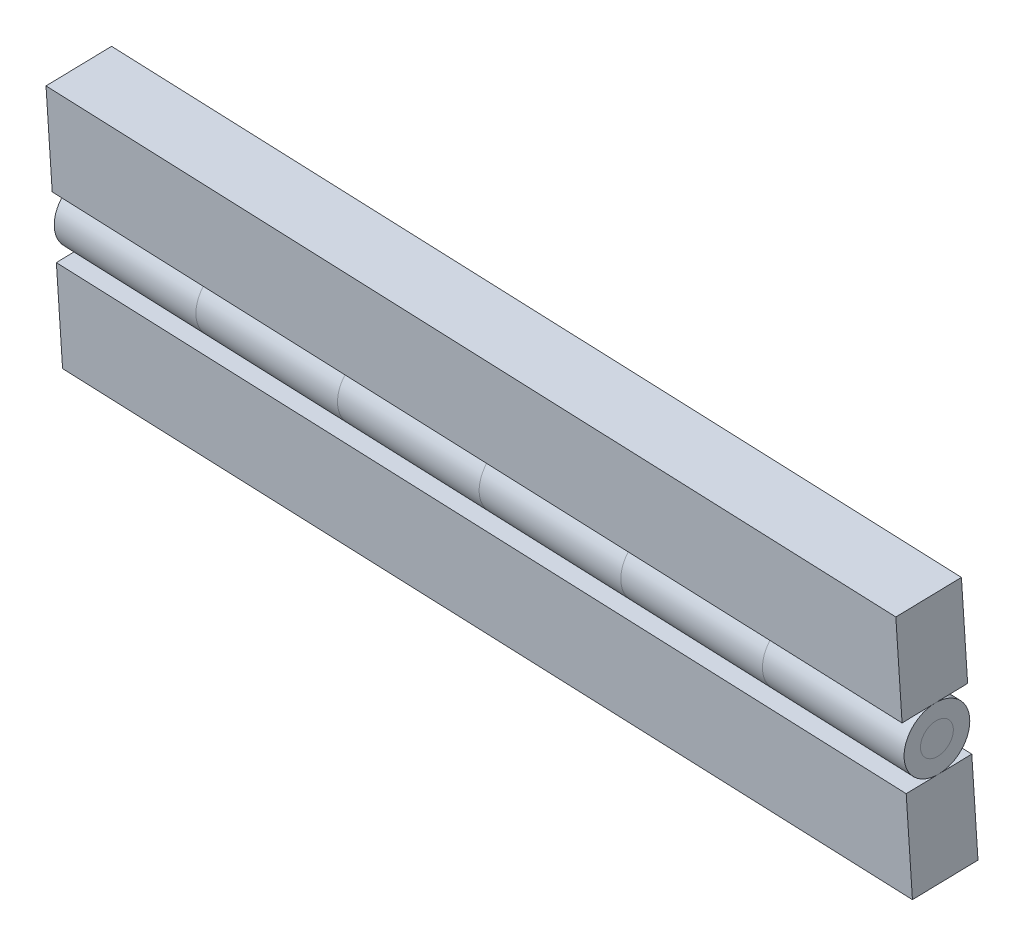
ISO-10303-21;
HEADER;
FILE_DESCRIPTION(('STEP AP214'),'2;1');
FILE_NAME('part.step','',(''),(''),'','','');
FILE_SCHEMA(('AUTOMOTIVE_DESIGN { 1 0 10303 214 1 1 1 1 }'));
ENDSEC;
DATA;
#1=APPLICATION_CONTEXT('core data for automotive mechanical design processes');
#2=APPLICATION_PROTOCOL_DEFINITION('international standard','automotive_design',2000,#1);
#3=PRODUCT_CONTEXT('',#1,'mechanical');
#4=PRODUCT('Part','Part','',(#3));
#5=PRODUCT_RELATED_PRODUCT_CATEGORY('part','',(#4));
#6=PRODUCT_DEFINITION_FORMATION('','',#4);
#7=PRODUCT_DEFINITION_CONTEXT('part definition',#1,'design');
#8=PRODUCT_DEFINITION('design','',#6,#7);
#9=PRODUCT_DEFINITION_SHAPE('','',#8);
#10=(LENGTH_UNIT() NAMED_UNIT(*) SI_UNIT(.MILLI.,.METRE.));
#11=(NAMED_UNIT(*) PLANE_ANGLE_UNIT() SI_UNIT($,.RADIAN.));
#12=(NAMED_UNIT(*) SI_UNIT($,.STERADIAN.) SOLID_ANGLE_UNIT());
#13=UNCERTAINTY_MEASURE_WITH_UNIT(LENGTH_MEASURE(1.E-05),#10,'distance_accuracy_value','');
#14=(GEOMETRIC_REPRESENTATION_CONTEXT(3) GLOBAL_UNCERTAINTY_ASSIGNED_CONTEXT((#13)) GLOBAL_UNIT_ASSIGNED_CONTEXT((#10,
#11,#12)) REPRESENTATION_CONTEXT('',''));
#15=CARTESIAN_POINT('',(0.,0.,0.));
#16=DIRECTION('',(0.,0.,1.));
#17=DIRECTION('',(1.,0.,0.));
#18=AXIS2_PLACEMENT_3D('',#15,#16,#17);
#19=CARTESIAN_POINT('',(-38.3742062643059,-23.8690353027162,37.3029888728331));
#20=DIRECTION('',(0.999218067831351,0.,0.0395379933656391));
#21=DIRECTION('',(-0.039425983073594,0.0752192234818832,0.996387304353816));
#22=AXIS2_PLACEMENT_3D('',#19,#20,#21);
#23=CYLINDRICAL_SURFACE('',#22,2.5);
#24=CARTESIAN_POINT('',(31.5710584838887,-23.8690353027163,40.0706484084279));
#25=DIRECTION('',(0.999218067831351,0.,0.0395379933656391));
#26=DIRECTION('',(-0.039425983073594,0.0752192234818832,0.996387304353816));
#27=AXIS2_PLACEMENT_3D('',#24,#25,#26);
#28=CIRCLE('',#27,2.5);
#29=CARTESIAN_POINT('',(31.4724935262047,-23.6809872440116,42.5616166693124));
#30=VERTEX_POINT('',#29);
#31=EDGE_CURVE('P0_E10',#30,#30,#28,.T.);
#32=ORIENTED_EDGE('',*,*,#31,.F.);
#33=EDGE_LOOP('',(#32));
#34=FACE_BOUND('',#33,.T.);
#35=CARTESIAN_POINT('',(-108.3194710125,-23.8690353027162,34.5353293372384));
#36=DIRECTION('',(0.999218067831351,0.,0.0395379933656391));
#37=DIRECTION('',(-0.039425983073594,0.0752192234818832,0.996387304353816));
#38=AXIS2_PLACEMENT_3D('',#35,#36,#37);
#39=CIRCLE('',#38,2.5);
#40=CARTESIAN_POINT('',(-108.418035970184,-23.6809872440115,37.0262975981229));
#41=VERTEX_POINT('',#40);
#42=EDGE_CURVE('P0_E19',#41,#41,#39,.T.);
#43=ORIENTED_EDGE('',*,*,#42,.T.);
#44=EDGE_LOOP('',(#43));
#45=FACE_BOUND('',#44,.T.);
#46=ADVANCED_FACE('P0_F15',(#34,#45),#23,.T.);
#47=CARTESIAN_POINT('',(-108.3194710125,-23.8690353027162,34.5353293372384));
#48=DIRECTION('',(0.999218067831351,0.,0.0395379933656391));
#49=DIRECTION('',(-0.039425983073594,0.0752192234818832,0.996387304353816));
#50=AXIS2_PLACEMENT_3D('',#47,#48,#49);
#51=PLANE('',#50);
#52=ORIENTED_EDGE('',*,*,#42,.F.);
#53=EDGE_LOOP('',(#52));
#54=FACE_BOUND('',#53,.T.);
#55=ADVANCED_FACE('P0_F29',(#54),#51,.F.);
#56=CARTESIAN_POINT('',(31.5710584838887,-23.8690353027163,40.0706484084279));
#57=DIRECTION('',(0.999218067831351,0.,0.0395379933656391));
#58=DIRECTION('',(-0.039425983073594,0.0752192234818832,0.996387304353816));
#59=AXIS2_PLACEMENT_3D('',#56,#57,#58);
#60=PLANE('',#59);
#61=ORIENTED_EDGE('',*,*,#31,.T.);
#62=EDGE_LOOP('',(#61));
#63=FACE_BOUND('',#62,.T.);
#64=ADVANCED_FACE('P0_F17',(#63),#60,.T.);
#65=CLOSED_SHELL('',(#46,#55,#64));
#66=MANIFOLD_SOLID_BREP('P0_B1',#65);
#67=CARTESIAN_POINT('',(19.9135143591896,-23.8690353027163,39.6093718191621));
#68=DIRECTION('',(0.999218067831351,0.,0.0395379933656391));
#69=DIRECTION('',(-0.0394591993984671,-0.0631012102172843,0.997226758993132));
#70=AXIS2_PLACEMENT_3D('',#67,#68,#69);
#71=CYLINDRICAL_SURFACE('',#70,5.);
#72=CARTESIAN_POINT('',(-85.0043827631022,-23.8690353027162,35.45788251577));
#73=DIRECTION('',(0.999218067831351,0.,0.0395379933656391));
#74=DIRECTION('',(-0.0394591993984671,-0.0631012102172843,0.997226758993132));
#75=AXIS2_PLACEMENT_3D('',#72,#73,#74);
#76=CIRCLE('',#75,5.);
#77=CARTESIAN_POINT('',(-85.2016787600946,-24.1845413538026,40.4440163107356));
#78=VERTEX_POINT('',#77);
#79=EDGE_CURVE('P1_E27',#78,#78,#76,.T.);
#80=ORIENTED_EDGE('',*,*,#79,.T.);
#81=EDGE_LOOP('',(#80));
#82=FACE_BOUND('',#81,.T.);
#83=CARTESIAN_POINT('',(-61.689294513704,-23.8690353027162,36.3804356943016));
#84=DIRECTION('',(0.999218067831351,0.,0.0395379933656391));
#85=DIRECTION('',(-0.0394591993984671,-0.0631012102172843,0.997226758993132));
#86=AXIS2_PLACEMENT_3D('',#83,#84,#85);
#87=CIRCLE('',#86,5.);
#88=CARTESIAN_POINT('',(-61.8865905106964,-24.1845413538026,41.3665694892672));
#89=VERTEX_POINT('',#88);
#90=EDGE_CURVE('P1_E9',#89,#89,#87,.T.);
#91=ORIENTED_EDGE('',*,*,#90,.F.);
#92=EDGE_LOOP('',(#91));
#93=FACE_BOUND('',#92,.T.);
#94=ADVANCED_FACE('P1_F14',(#82,#93),#71,.T.);
#95=CARTESIAN_POINT('',(-61.8990649868511,-19.1945056894283,41.6818288360229));
#96=DIRECTION('',(-0.999218067831351,0.,-0.0395379933656391));
#97=DIRECTION('',(0.0394591993984671,0.0631012102172843,-0.997226758993132));
#98=AXIS2_PLACEMENT_3D('',#95,#96,#97);
#99=PLANE('',#98);
#100=ORIENTED_EDGE('',*,*,#90,.T.);
#101=EDGE_LOOP('',(#100));
#102=FACE_BOUND('',#101,.T.);
#103=CARTESIAN_POINT('',(-61.689294513704,-23.8690353027162,36.3804356943016));
#104=DIRECTION('',(0.999218067831351,0.,0.0395379933656391));
#105=DIRECTION('',(0.0394591993984671,0.0631012102172843,-0.997226758993132));
#106=AXIS2_PLACEMENT_3D('',#103,#104,#105);
#107=CIRCLE('',#106,2.5);
#108=CARTESIAN_POINT('',(-61.5906465152079,-23.711282277173,33.8873687968187));
#109=VERTEX_POINT('',#108);
#110=EDGE_CURVE('P1_E22',#109,#109,#107,.T.);
#111=ORIENTED_EDGE('',*,*,#110,.F.);
#112=EDGE_LOOP('',(#111));
#113=FACE_BOUND('',#112,.T.);
#114=ADVANCED_FACE('P1_F41',(#102,#113),#99,.F.);
#115=CARTESIAN_POINT('',(-85.2328649504812,-11.7094521928668,41.2321646776248));
#116=DIRECTION('',(0.999218067831351,0.,0.0395379933656391));
#117=DIRECTION('',(-0.0394591993984671,-0.0631012102172843,0.997226758993132));
#118=AXIS2_PLACEMENT_3D('',#115,#116,#117);
#119=PLANE('',#118);
#120=ORIENTED_EDGE('',*,*,#79,.F.);
#121=EDGE_LOOP('',(#120));
#122=FACE_BOUND('',#121,.T.);
#123=CARTESIAN_POINT('',(-85.0043827631022,-23.8690353027162,35.45788251577));
#124=DIRECTION('',(0.999218067831351,0.,0.0395379933656391));
#125=DIRECTION('',(-0.0394591993984671,-0.0631012102172843,0.997226758993132));
#126=AXIS2_PLACEMENT_3D('',#123,#124,#125);
#127=CIRCLE('',#126,2.5);
#128=CARTESIAN_POINT('',(-85.1030307615984,-24.0267883282594,37.9509494132528));
#129=VERTEX_POINT('',#128);
#130=EDGE_CURVE('P1_E18',#129,#129,#127,.T.);
#131=ORIENTED_EDGE('',*,*,#130,.T.);
#132=EDGE_LOOP('',(#131));
#133=FACE_BOUND('',#132,.T.);
#134=ADVANCED_FACE('P1_F35',(#122,#133),#119,.F.);
#135=CARTESIAN_POINT('',(19.9135143591896,-23.8690353027163,39.6093718191621));
#136=DIRECTION('',(0.999218067831351,0.,0.0395379933656391));
#137=DIRECTION('',(-0.0394591993984671,-0.0631012102172843,0.997226758993132));
#138=AXIS2_PLACEMENT_3D('',#135,#136,#137);
#139=CYLINDRICAL_SURFACE('',#138,2.5);
#140=ORIENTED_EDGE('',*,*,#130,.F.);
#141=EDGE_LOOP('',(#140));
#142=FACE_BOUND('',#141,.T.);
#143=ORIENTED_EDGE('',*,*,#110,.T.);
#144=EDGE_LOOP('',(#143));
#145=FACE_BOUND('',#144,.T.);
#146=ADVANCED_FACE('P1_F16',(#142,#145),#139,.F.);
#147=CLOSED_SHELL('',(#94,#114,#134,#146));
#148=MANIFOLD_SOLID_BREP('P1_B1',#147);
#149=CARTESIAN_POINT('',(19.9135143591896,-23.8690353027163,39.6093718191621));
#150=DIRECTION('',(0.999218067831351,0.,0.0395379933656391));
#151=DIRECTION('',(-0.0394591993984671,-0.0631012102172843,0.997226758993132));
#152=AXIS2_PLACEMENT_3D('',#149,#150,#151);
#153=CYLINDRICAL_SURFACE('',#152,5.);
#154=CARTESIAN_POINT('',(-38.3742062643059,-23.8690353027162,37.3029888728331));
#155=DIRECTION('',(0.999218067831351,0.,0.0395379933656391));
#156=DIRECTION('',(-0.0394591993984671,-0.0631012102172843,0.997226758993132));
#157=AXIS2_PLACEMENT_3D('',#154,#155,#156);
#158=CIRCLE('',#157,5.);
#159=CARTESIAN_POINT('',(-38.5715022612982,-24.1845413538027,42.2891226677988));
#160=VERTEX_POINT('',#159);
#161=EDGE_CURVE('P2_E28',#160,#160,#158,.T.);
#162=ORIENTED_EDGE('',*,*,#161,.T.);
#163=EDGE_LOOP('',(#162));
#164=FACE_BOUND('',#163,.T.);
#165=CARTESIAN_POINT('',(-15.0591180149077,-23.8690353027163,38.2255420513647));
#166=DIRECTION('',(0.999218067831351,0.,0.0395379933656391));
#167=DIRECTION('',(-0.0394591993984671,-0.0631012102172843,0.997226758993132));
#168=AXIS2_PLACEMENT_3D('',#165,#166,#167);
#169=CIRCLE('',#168,5.);
#170=CARTESIAN_POINT('',(-15.2564140119,-24.1845413538027,43.2116758463304));
#171=VERTEX_POINT('',#170);
#172=EDGE_CURVE('P2_E10',#171,#171,#169,.T.);
#173=ORIENTED_EDGE('',*,*,#172,.F.);
#174=EDGE_LOOP('',(#173));
#175=FACE_BOUND('',#174,.T.);
#176=ADVANCED_FACE('P2_F15',(#164,#175),#153,.T.);
#177=CARTESIAN_POINT('',(-15.2688884880547,-19.1945056894284,43.526935193086));
#178=DIRECTION('',(-0.999218067831351,0.,-0.0395379933656391));
#179=DIRECTION('',(0.0394591993984671,0.0631012102172843,-0.997226758993132));
#180=AXIS2_PLACEMENT_3D('',#177,#178,#179);
#181=PLANE('',#180);
#182=ORIENTED_EDGE('',*,*,#172,.T.);
#183=EDGE_LOOP('',(#182));
#184=FACE_BOUND('',#183,.T.);
#185=CARTESIAN_POINT('',(-15.0591180149077,-23.8690353027163,38.2255420513647));
#186=DIRECTION('',(0.999218067831351,0.,0.0395379933656391));
#187=DIRECTION('',(0.0394591993984671,0.0631012102172843,-0.997226758993132));
#188=AXIS2_PLACEMENT_3D('',#185,#186,#187);
#189=CIRCLE('',#188,2.5);
#190=CARTESIAN_POINT('',(-14.9604700164115,-23.7112822771731,35.7324751538819));
#191=VERTEX_POINT('',#190);
#192=EDGE_CURVE('P2_E23',#191,#191,#189,.T.);
#193=ORIENTED_EDGE('',*,*,#192,.F.);
#194=EDGE_LOOP('',(#193));
#195=FACE_BOUND('',#194,.T.);
#196=ADVANCED_FACE('P2_F42',(#184,#195),#181,.F.);
#197=CARTESIAN_POINT('',(-38.6026884516849,-11.7094521928668,43.077271034688));
#198=DIRECTION('',(0.999218067831351,0.,0.0395379933656391));
#199=DIRECTION('',(-0.0394591993984671,-0.0631012102172843,0.997226758993132));
#200=AXIS2_PLACEMENT_3D('',#197,#198,#199);
#201=PLANE('',#200);
#202=ORIENTED_EDGE('',*,*,#161,.F.);
#203=EDGE_LOOP('',(#202));
#204=FACE_BOUND('',#203,.T.);
#205=CARTESIAN_POINT('',(-38.3742062643059,-23.8690353027162,37.3029888728331));
#206=DIRECTION('',(0.999218067831351,0.,0.0395379933656391));
#207=DIRECTION('',(-0.0394591993984671,-0.0631012102172843,0.997226758993132));
#208=AXIS2_PLACEMENT_3D('',#205,#206,#207);
#209=CIRCLE('',#208,2.5);
#210=CARTESIAN_POINT('',(-38.472854262802,-24.0267883282595,39.796055770316));
#211=VERTEX_POINT('',#210);
#212=EDGE_CURVE('P2_E19',#211,#211,#209,.T.);
#213=ORIENTED_EDGE('',*,*,#212,.T.);
#214=EDGE_LOOP('',(#213));
#215=FACE_BOUND('',#214,.T.);
#216=ADVANCED_FACE('P2_F36',(#204,#215),#201,.F.);
#217=CARTESIAN_POINT('',(19.9135143591896,-23.8690353027163,39.6093718191621));
#218=DIRECTION('',(0.999218067831351,0.,0.0395379933656391));
#219=DIRECTION('',(-0.0394591993984671,-0.0631012102172843,0.997226758993132));
#220=AXIS2_PLACEMENT_3D('',#217,#218,#219);
#221=CYLINDRICAL_SURFACE('',#220,2.5);
#222=ORIENTED_EDGE('',*,*,#212,.F.);
#223=EDGE_LOOP('',(#222));
#224=FACE_BOUND('',#223,.T.);
#225=ORIENTED_EDGE('',*,*,#192,.T.);
#226=EDGE_LOOP('',(#225));
#227=FACE_BOUND('',#226,.T.);
#228=ADVANCED_FACE('P2_F17',(#224,#227),#221,.F.);
#229=CLOSED_SHELL('',(#176,#196,#216,#228));
#230=MANIFOLD_SOLID_BREP('P2_B1',#229);
#231=CARTESIAN_POINT('',(-108.566664914111,-4.22439869630523,40.7825005192268));
#232=DIRECTION('',(0.999218067831351,0.,0.0395379933656391));
#233=DIRECTION('',(-0.0394591993984671,-0.0631012102172843,0.997226758993132));
#234=AXIS2_PLACEMENT_3D('',#231,#232,#233);
#235=PLANE('',#234);
#236=DIRECTION('',(-0.00249489523093393,0.998007132874868,0.0630518693511348));
#237=VECTOR('',#236,1.);
#238=CARTESIAN_POINT('',(-108.153361205895,-11.0784400906939,30.3373439091619));
#239=LINE('',#238,#237);
#240=CARTESIAN_POINT('',(-108.134649491663,-18.5634935872554,29.8644548890284));
#241=VERTEX_POINT('',#240);
#242=CARTESIAN_POINT('',(-108.172072920127,-3.59338659413239,30.8102329292954));
#243=VERTEX_POINT('',#242);
#244=EDGE_CURVE('P3_E11',#241,#243,#239,.T.);
#245=ORIENTED_EDGE('',*,*,#244,.F.);
#246=DIRECTION('',(0.0394591993984671,0.0631012102172843,-0.997226758993132));
#247=VECTOR('',#246,1.);
#248=CARTESIAN_POINT('',(-108.331945488655,-18.8789996383419,34.8505886839941));
#249=LINE('',#248,#247);
#250=CARTESIAN_POINT('',(-108.529241485647,-19.1945056894283,39.8367224789597));
#251=VERTEX_POINT('',#250);
#252=EDGE_CURVE('P3_E27',#251,#241,#249,.T.);
#253=ORIENTED_EDGE('',*,*,#252,.F.);
#254=DIRECTION('',(-0.00249489523093393,0.998007132874868,0.0630518693511348));
#255=VECTOR('',#254,1.);
#256=CARTESIAN_POINT('',(-108.547953199879,-11.7094521928668,40.3096114990932));
#257=LINE('',#256,#255);
#258=CARTESIAN_POINT('',(-108.566664914111,-4.22439869630523,40.7825005192268));
#259=VERTEX_POINT('',#258);
#260=EDGE_CURVE('P3_E75',#251,#259,#257,.T.);
#261=ORIENTED_EDGE('',*,*,#260,.T.);
#262=DIRECTION('',(0.0394591993984671,0.0631012102172843,-0.997226758993132));
#263=VECTOR('',#262,1.);
#264=CARTESIAN_POINT('',(-108.369368917119,-3.90889264521881,35.7963667242611));
#265=LINE('',#264,#263);
#266=EDGE_CURVE('P3_E36',#259,#243,#265,.T.);
#267=ORIENTED_EDGE('',*,*,#266,.T.);
#268=EDGE_LOOP('',(#245,#253,#261,#267));
#269=FACE_BOUND('',#268,.T.);
#270=ADVANCED_FACE('P3_F17',(#269),#235,.F.);
#271=CARTESIAN_POINT('',(31.3238645822777,-4.22439869630536,46.3178195904162));
#272=DIRECTION('',(0.00249489523093393,-0.998007132874868,-0.0630518693511348));
#273=DIRECTION('',(0.0394591993984671,0.0631012102172843,-0.997226758993132));
#274=AXIS2_PLACEMENT_3D('',#271,#272,#273);
#275=PLANE('',#274);
#276=DIRECTION('',(0.999218067831351,0.,0.0395379933656391));
#277=VECTOR('',#276,1.);
#278=CARTESIAN_POINT('',(-38.2268081719322,-3.59338659413245,33.5778924648902));
#279=LINE('',#278,#277);
#280=CARTESIAN_POINT('',(31.7184565762624,-3.59338659413251,36.3455520004849));
#281=VERTEX_POINT('',#280);
#282=EDGE_CURVE('P3_E83',#243,#281,#279,.T.);
#283=ORIENTED_EDGE('',*,*,#282,.F.);
#284=ORIENTED_EDGE('',*,*,#266,.F.);
#285=DIRECTION('',(0.999218067831351,0.,0.0395379933656391));
#286=VECTOR('',#285,1.);
#287=CARTESIAN_POINT('',(-38.6214001659169,-4.2243986963053,43.5501600548215));
#288=LINE('',#287,#286);
#289=CARTESIAN_POINT('',(31.3238645822777,-4.22439869630536,46.3178195904162));
#290=VERTEX_POINT('',#289);
#291=EDGE_CURVE('P3_E72',#259,#290,#288,.T.);
#292=ORIENTED_EDGE('',*,*,#291,.T.);
#293=DIRECTION('',(0.0394591993984671,0.0631012102172843,-0.997226758993132));
#294=VECTOR('',#293,1.);
#295=CARTESIAN_POINT('',(31.52116057927,-3.90889264521894,41.3316857954506));
#296=LINE('',#295,#294);
#297=EDGE_CURVE('P3_E69',#290,#281,#296,.T.);
#298=ORIENTED_EDGE('',*,*,#297,.T.);
#299=EDGE_LOOP('',(#283,#284,#292,#298));
#300=FACE_BOUND('',#299,.T.);
#301=ADVANCED_FACE('P3_F91',(#300),#275,.F.);
#302=CARTESIAN_POINT('',(31.3612880107417,-19.1945056894284,45.3720415501492));
#303=DIRECTION('',(-0.999218067831351,0.,-0.0395379933656391));
#304=DIRECTION('',(0.0394591993984671,0.0631012102172843,-0.997226758993132));
#305=AXIS2_PLACEMENT_3D('',#302,#303,#304);
#306=PLANE('',#305);
#307=DIRECTION('',(0.00249489523093393,-0.998007132874868,-0.0630518693511348));
#308=VECTOR('',#307,1.);
#309=CARTESIAN_POINT('',(31.7371682904944,-11.078440090694,35.8726629803514));
#310=LINE('',#309,#308);
#311=CARTESIAN_POINT('',(31.7558800047264,-18.5634935872555,35.3997739602179));
#312=VERTEX_POINT('',#311);
#313=EDGE_CURVE('P3_E77',#281,#312,#310,.T.);
#314=ORIENTED_EDGE('',*,*,#313,.F.);
#315=ORIENTED_EDGE('',*,*,#297,.F.);
#316=DIRECTION('',(0.00249489523093393,-0.998007132874868,-0.0630518693511348));
#317=VECTOR('',#316,1.);
#318=CARTESIAN_POINT('',(31.3425762965097,-11.7094521928669,45.8449305702827));
#319=LINE('',#318,#317);
#320=CARTESIAN_POINT('',(31.3612880107417,-19.1945056894284,45.3720415501492));
#321=VERTEX_POINT('',#320);
#322=EDGE_CURVE('P3_E64',#290,#321,#319,.T.);
#323=ORIENTED_EDGE('',*,*,#322,.T.);
#324=DIRECTION('',(0.0394591993984671,0.0631012102172843,-0.997226758993132));
#325=VECTOR('',#324,1.);
#326=CARTESIAN_POINT('',(31.6572320062302,-18.7212466127988,37.8928408577007));
#327=LINE('',#326,#325);
#328=EDGE_CURVE('P3_E55',#321,#312,#327,.T.);
#329=ORIENTED_EDGE('',*,*,#328,.T.);
#330=EDGE_LOOP('',(#314,#315,#323,#329));
#331=FACE_BOUND('',#330,.T.);
#332=ADVANCED_FACE('P3_F68',(#331),#306,.F.);
#333=CARTESIAN_POINT('',(-38.6026884516849,-11.7094521928668,43.077271034688));
#334=DIRECTION('',(0.0394591993984671,0.0631012102172843,-0.997226758993132));
#335=DIRECTION('',(0.999218067831351,0.,0.0395379933656391));
#336=AXIS2_PLACEMENT_3D('',#333,#334,#335);
#337=PLANE('',#336);
#338=DIRECTION('',(-0.999218067831351,0.,-0.0395379933656391));
#339=VECTOR('',#338,1.);
#340=CARTESIAN_POINT('',(-38.5839767374529,-19.1945056894283,42.6043820145545));
#341=LINE('',#340,#339);
#342=EDGE_CURVE('P3_E62',#321,#251,#341,.T.);
#343=ORIENTED_EDGE('',*,*,#342,.F.);
#344=ORIENTED_EDGE('',*,*,#322,.F.);
#345=ORIENTED_EDGE('',*,*,#291,.F.);
#346=ORIENTED_EDGE('',*,*,#260,.F.);
#347=EDGE_LOOP('',(#343,#344,#345,#346));
#348=FACE_BOUND('',#347,.T.);
#349=ADVANCED_FACE('P3_F74',(#348),#337,.F.);
#350=CARTESIAN_POINT('',(-38.2080964577002,-11.078440090694,33.1050034447567));
#351=DIRECTION('',(0.0394591993984671,0.0631012102172843,-0.997226758993132));
#352=DIRECTION('',(0.999218067831351,0.,0.0395379933656391));
#353=AXIS2_PLACEMENT_3D('',#350,#351,#352);
#354=PLANE('',#353);
#355=ORIENTED_EDGE('',*,*,#313,.T.);
#356=DIRECTION('',(-0.999218067831351,0.,-0.0395379933656391));
#357=VECTOR('',#356,1.);
#358=CARTESIAN_POINT('',(-38.1893847434682,-18.5634935872555,32.6321144246232));
#359=LINE('',#358,#357);
#360=EDGE_CURVE('P3_E21',#312,#241,#359,.T.);
#361=ORIENTED_EDGE('',*,*,#360,.T.);
#362=ORIENTED_EDGE('',*,*,#244,.T.);
#363=ORIENTED_EDGE('',*,*,#282,.T.);
#364=EDGE_LOOP('',(#355,#361,#362,#363));
#365=FACE_BOUND('',#364,.T.);
#366=ADVANCED_FACE('P3_F89',(#365),#354,.T.);
#367=CARTESIAN_POINT('',(-108.529241485647,-19.1945056894283,39.8367224789597));
#368=DIRECTION('',(-0.00249489523093393,0.998007132874868,0.0630518693511348));
#369=DIRECTION('',(-0.0394591993984671,-0.0631012102172843,0.997226758993132));
#370=AXIS2_PLACEMENT_3D('',#367,#368,#369);
#371=PLANE('',#370);
#372=ORIENTED_EDGE('',*,*,#328,.F.);
#373=ORIENTED_EDGE('',*,*,#342,.T.);
#374=ORIENTED_EDGE('',*,*,#252,.T.);
#375=ORIENTED_EDGE('',*,*,#360,.F.);
#376=EDGE_LOOP('',(#372,#373,#374,#375));
#377=FACE_BOUND('',#376,.T.);
#378=ADVANCED_FACE('P3_F19',(#377),#371,.F.);
#379=CLOSED_SHELL('',(#270,#301,#332,#349,#366,#378));
#380=MANIFOLD_SOLID_BREP('P3_B1',#379);
#381=CARTESIAN_POINT('',(19.9135143591896,-23.8690353027163,39.6093718191621));
#382=DIRECTION('',(0.999218067831351,0.,0.0395379933656391));
#383=DIRECTION('',(-0.0394591993984671,-0.0631012102172843,0.997226758993132));
#384=AXIS2_PLACEMENT_3D('',#381,#382,#383);
#385=CYLINDRICAL_SURFACE('',#384,5.);
#386=CARTESIAN_POINT('',(8.25597023449053,-23.8690353027163,39.1480952298963));
#387=DIRECTION('',(0.999218067831351,0.,0.0395379933656391));
#388=DIRECTION('',(-0.0394591993984671,-0.0631012102172843,0.997226758993132));
#389=AXIS2_PLACEMENT_3D('',#386,#387,#388);
#390=CIRCLE('',#389,5.);
#391=CARTESIAN_POINT('',(8.0586742374982,-24.1845413538027,44.134229024862));
#392=VERTEX_POINT('',#391);
#393=EDGE_CURVE('P4_E29',#392,#392,#390,.T.);
#394=ORIENTED_EDGE('',*,*,#393,.T.);
#395=EDGE_LOOP('',(#394));
#396=FACE_BOUND('',#395,.T.);
#397=CARTESIAN_POINT('',(31.5710584838887,-23.8690353027163,40.0706484084279));
#398=DIRECTION('',(0.999218067831351,0.,0.0395379933656391));
#399=DIRECTION('',(-0.0394591993984671,-0.0631012102172843,0.997226758993132));
#400=AXIS2_PLACEMENT_3D('',#397,#398,#399);
#401=CIRCLE('',#400,5.);
#402=CARTESIAN_POINT('',(31.3737624868964,-24.1845413538027,45.0567822033935));
#403=VERTEX_POINT('',#402);
#404=EDGE_CURVE('P4_E10',#403,#403,#401,.T.);
#405=ORIENTED_EDGE('',*,*,#404,.F.);
#406=EDGE_LOOP('',(#405));
#407=FACE_BOUND('',#406,.T.);
#408=ADVANCED_FACE('P4_F15',(#396,#407),#385,.T.);
#409=CARTESIAN_POINT('',(19.9135143591896,-23.8690353027163,39.6093718191621));
#410=DIRECTION('',(0.999218067831351,0.,0.0395379933656391));
#411=DIRECTION('',(-0.0394591993984671,-0.0631012102172843,0.997226758993132));
#412=AXIS2_PLACEMENT_3D('',#409,#410,#411);
#413=CYLINDRICAL_SURFACE('',#412,2.5);
#414=CARTESIAN_POINT('',(8.25597023449053,-23.8690353027163,39.1480952298963));
#415=DIRECTION('',(0.999218067831351,0.,0.0395379933656391));
#416=DIRECTION('',(-0.0394591993984671,-0.0631012102172843,0.997226758993132));
#417=AXIS2_PLACEMENT_3D('',#414,#415,#416);
#418=CIRCLE('',#417,2.5);
#419=CARTESIAN_POINT('',(8.15732223599436,-24.0267883282595,41.6411621273791));
#420=VERTEX_POINT('',#419);
#421=EDGE_CURVE('P4_E23',#420,#420,#418,.T.);
#422=ORIENTED_EDGE('',*,*,#421,.F.);
#423=EDGE_LOOP('',(#422));
#424=FACE_BOUND('',#423,.T.);
#425=CARTESIAN_POINT('',(31.5710584838887,-23.8690353027163,40.0706484084279));
#426=DIRECTION('',(0.999218067831351,0.,0.0395379933656391));
#427=DIRECTION('',(-0.0394591993984671,-0.0631012102172843,0.997226758993132));
#428=AXIS2_PLACEMENT_3D('',#425,#426,#427);
#429=CIRCLE('',#428,2.5);
#430=CARTESIAN_POINT('',(31.4724104853925,-24.0267883282595,42.5637153059107));
#431=VERTEX_POINT('',#430);
#432=EDGE_CURVE('P4_E19',#431,#431,#429,.T.);
#433=ORIENTED_EDGE('',*,*,#432,.T.);
#434=EDGE_LOOP('',(#433));
#435=FACE_BOUND('',#434,.T.);
#436=ADVANCED_FACE('P4_F36',(#424,#435),#413,.F.);
#437=CARTESIAN_POINT('',(31.3612880107417,-19.1945056894284,45.3720415501492));
#438=DIRECTION('',(-0.999218067831351,0.,-0.0395379933656391));
#439=DIRECTION('',(0.0394591993984671,0.0631012102172843,-0.997226758993132));
#440=AXIS2_PLACEMENT_3D('',#437,#438,#439);
#441=PLANE('',#440);
#442=ORIENTED_EDGE('',*,*,#404,.T.);
#443=EDGE_LOOP('',(#442));
#444=FACE_BOUND('',#443,.T.);
#445=ORIENTED_EDGE('',*,*,#432,.F.);
#446=EDGE_LOOP('',(#445));
#447=FACE_BOUND('',#446,.T.);
#448=ADVANCED_FACE('P4_F38',(#444,#447),#441,.F.);
#449=CARTESIAN_POINT('',(8.02748804711152,-11.7094521928669,44.9223773917511));
#450=DIRECTION('',(0.999218067831351,0.,0.0395379933656391));
#451=DIRECTION('',(-0.0394591993984671,-0.0631012102172843,0.997226758993132));
#452=AXIS2_PLACEMENT_3D('',#449,#450,#451);
#453=PLANE('',#452);
#454=ORIENTED_EDGE('',*,*,#393,.F.);
#455=EDGE_LOOP('',(#454));
#456=FACE_BOUND('',#455,.T.);
#457=ORIENTED_EDGE('',*,*,#421,.T.);
#458=EDGE_LOOP('',(#457));
#459=FACE_BOUND('',#458,.T.);
#460=ADVANCED_FACE('P4_F17',(#456,#459),#453,.F.);
#461=CLOSED_SHELL('',(#408,#436,#448,#460));
#462=MANIFOLD_SOLID_BREP('P4_B1',#461);
#463=CARTESIAN_POINT('',(-96.6619268878013,-23.8690353027162,34.9966059265042));
#464=DIRECTION('',(-0.999218067831351,0.,-0.0395379933656391));
#465=DIRECTION('',(-0.0394591993984672,-0.0631012102172478,0.997226758993134));
#466=AXIS2_PLACEMENT_3D('',#463,#464,#465);
#467=CYLINDRICAL_SURFACE('',#466,5.);
#468=CARTESIAN_POINT('',(8.25597023449056,-23.8690353027163,39.1480952298963));
#469=DIRECTION('',(-0.999218067831351,0.,-0.0395379933656391));
#470=DIRECTION('',(-0.0394591993984672,-0.0631012102172478,0.997226758993134));
#471=AXIS2_PLACEMENT_3D('',#468,#469,#470);
#472=CIRCLE('',#471,5.);
#473=CARTESIAN_POINT('',(8.05867423749822,-24.1845413538025,44.134229024862));
#474=VERTEX_POINT('',#473);
#475=EDGE_CURVE('P5_E28',#474,#474,#472,.T.);
#476=ORIENTED_EDGE('',*,*,#475,.T.);
#477=EDGE_LOOP('',(#476));
#478=FACE_BOUND('',#477,.T.);
#479=CARTESIAN_POINT('',(-15.0591180149076,-23.8690353027163,38.2255420513647));
#480=DIRECTION('',(-0.999218067831351,0.,-0.0395379933656391));
#481=DIRECTION('',(-0.0394591993984672,-0.0631012102172478,0.997226758993134));
#482=AXIS2_PLACEMENT_3D('',#479,#480,#481);
#483=CIRCLE('',#482,5.);
#484=CARTESIAN_POINT('',(-15.2564140119,-24.1845413538025,43.2116758463304));
#485=VERTEX_POINT('',#484);
#486=EDGE_CURVE('P5_E10',#485,#485,#483,.T.);
#487=ORIENTED_EDGE('',*,*,#486,.F.);
#488=EDGE_LOOP('',(#487));
#489=FACE_BOUND('',#488,.T.);
#490=ADVANCED_FACE('P5_F15',(#478,#489),#467,.T.);
#491=CARTESIAN_POINT('',(-15.2439395357453,-29.1745770181768,42.8964164995749));
#492=DIRECTION('',(0.999218067831351,0.,0.0395379933656391));
#493=DIRECTION('',(0.0394591993984672,0.0631012102172478,-0.997226758993134));
#494=AXIS2_PLACEMENT_3D('',#491,#492,#493);
#495=PLANE('',#494);
#496=ORIENTED_EDGE('',*,*,#486,.T.);
#497=EDGE_LOOP('',(#496));
#498=FACE_BOUND('',#497,.T.);
#499=CARTESIAN_POINT('',(-15.0591180149076,-23.8690353027163,38.2255420513647));
#500=DIRECTION('',(-0.999218067831351,0.,-0.0395379933656391));
#501=DIRECTION('',(0.0394591993984672,0.0631012102172478,-0.997226758993134));
#502=AXIS2_PLACEMENT_3D('',#499,#500,#501);
#503=CIRCLE('',#502,2.5);
#504=CARTESIAN_POINT('',(-14.9604700164115,-23.7112822771731,35.7324751538819));
#505=VERTEX_POINT('',#504);
#506=EDGE_CURVE('P5_E23',#505,#505,#503,.T.);
#507=ORIENTED_EDGE('',*,*,#506,.F.);
#508=EDGE_LOOP('',(#507));
#509=FACE_BOUND('',#508,.T.);
#510=ADVANCED_FACE('P5_F42',(#498,#509),#495,.F.);
#511=CARTESIAN_POINT('',(8.08986042788487,-36.6596305147384,43.3460806579732));
#512=DIRECTION('',(-0.999218067831351,0.,-0.0395379933656391));
#513=DIRECTION('',(-0.0394591993984672,-0.0631012102172478,0.997226758993134));
#514=AXIS2_PLACEMENT_3D('',#511,#512,#513);
#515=PLANE('',#514);
#516=ORIENTED_EDGE('',*,*,#475,.F.);
#517=EDGE_LOOP('',(#516));
#518=FACE_BOUND('',#517,.T.);
#519=CARTESIAN_POINT('',(8.25597023449055,-23.8690353027163,39.1480952298963));
#520=DIRECTION('',(-0.999218067831351,0.,-0.0395379933656391));
#521=DIRECTION('',(-0.0394591993984672,-0.0631012102172478,0.997226758993134));
#522=AXIS2_PLACEMENT_3D('',#519,#520,#521);
#523=CIRCLE('',#522,2.5);
#524=CARTESIAN_POINT('',(8.15732223599439,-24.0267883282594,41.6411621273791));
#525=VERTEX_POINT('',#524);
#526=EDGE_CURVE('P5_E19',#525,#525,#523,.T.);
#527=ORIENTED_EDGE('',*,*,#526,.T.);
#528=EDGE_LOOP('',(#527));
#529=FACE_BOUND('',#528,.T.);
#530=ADVANCED_FACE('P5_F36',(#518,#529),#515,.F.);
#531=CARTESIAN_POINT('',(-96.6619268878013,-23.8690353027162,34.9966059265042));
#532=DIRECTION('',(-0.999218067831351,0.,-0.0395379933656391));
#533=DIRECTION('',(-0.0394591993984672,-0.0631012102172478,0.997226758993134));
#534=AXIS2_PLACEMENT_3D('',#531,#532,#533);
#535=CYLINDRICAL_SURFACE('',#534,2.5);
#536=ORIENTED_EDGE('',*,*,#526,.F.);
#537=EDGE_LOOP('',(#536));
#538=FACE_BOUND('',#537,.T.);
#539=ORIENTED_EDGE('',*,*,#506,.T.);
#540=EDGE_LOOP('',(#539));
#541=FACE_BOUND('',#540,.T.);
#542=ADVANCED_FACE('P5_F17',(#538,#541),#535,.F.);
#543=CLOSED_SHELL('',(#490,#510,#530,#542));
#544=MANIFOLD_SOLID_BREP('P5_B1',#543);
#545=CARTESIAN_POINT('',(-96.6619268878013,-23.8690353027162,34.9966059265042));
#546=DIRECTION('',(-0.999218067831351,0.,-0.0395379933656391));
#547=DIRECTION('',(-0.0394591993984672,-0.0631012102172478,0.997226758993134));
#548=AXIS2_PLACEMENT_3D('',#545,#546,#547);
#549=CYLINDRICAL_SURFACE('',#548,5.);
#550=CARTESIAN_POINT('',(-38.3742062643058,-23.8690353027162,37.3029888728331));
#551=DIRECTION('',(-0.999218067831351,0.,-0.0395379933656391));
#552=DIRECTION('',(-0.0394591993984672,-0.0631012102172478,0.997226758993134));
#553=AXIS2_PLACEMENT_3D('',#550,#551,#552);
#554=CIRCLE('',#553,5.);
#555=CARTESIAN_POINT('',(-38.5715022612982,-24.1845413538025,42.2891226677988));
#556=VERTEX_POINT('',#555);
#557=EDGE_CURVE('P6_E28',#556,#556,#554,.T.);
#558=ORIENTED_EDGE('',*,*,#557,.T.);
#559=EDGE_LOOP('',(#558));
#560=FACE_BOUND('',#559,.T.);
#561=CARTESIAN_POINT('',(-61.689294513704,-23.8690353027162,36.3804356943015));
#562=DIRECTION('',(-0.999218067831351,0.,-0.0395379933656391));
#563=DIRECTION('',(-0.0394591993984672,-0.0631012102172478,0.997226758993134));
#564=AXIS2_PLACEMENT_3D('',#561,#562,#563);
#565=CIRCLE('',#564,5.);
#566=CARTESIAN_POINT('',(-61.8865905106964,-24.1845413538025,41.3665694892672));
#567=VERTEX_POINT('',#566);
#568=EDGE_CURVE('P6_E10',#567,#567,#565,.T.);
#569=ORIENTED_EDGE('',*,*,#568,.F.);
#570=EDGE_LOOP('',(#569));
#571=FACE_BOUND('',#570,.T.);
#572=ADVANCED_FACE('P6_F15',(#560,#571),#549,.T.);
#573=CARTESIAN_POINT('',(-61.8741160345417,-29.1745770181768,41.0513101425117));
#574=DIRECTION('',(0.999218067831351,0.,0.0395379933656391));
#575=DIRECTION('',(0.0394591993984672,0.0631012102172478,-0.997226758993134));
#576=AXIS2_PLACEMENT_3D('',#573,#574,#575);
#577=PLANE('',#576);
#578=ORIENTED_EDGE('',*,*,#568,.T.);
#579=EDGE_LOOP('',(#578));
#580=FACE_BOUND('',#579,.T.);
#581=CARTESIAN_POINT('',(-61.689294513704,-23.8690353027162,36.3804356943015));
#582=DIRECTION('',(-0.999218067831351,0.,-0.0395379933656391));
#583=DIRECTION('',(0.0394591993984672,0.0631012102172478,-0.997226758993134));
#584=AXIS2_PLACEMENT_3D('',#581,#582,#583);
#585=CIRCLE('',#584,2.5);
#586=CARTESIAN_POINT('',(-61.5906465152079,-23.7112822771731,33.8873687968187));
#587=VERTEX_POINT('',#586);
#588=EDGE_CURVE('P6_E23',#587,#587,#585,.T.);
#589=ORIENTED_EDGE('',*,*,#588,.F.);
#590=EDGE_LOOP('',(#589));
#591=FACE_BOUND('',#590,.T.);
#592=ADVANCED_FACE('P6_F42',(#580,#591),#577,.F.);
#593=CARTESIAN_POINT('',(-38.5403160709115,-36.6596305147384,41.5009743009101));
#594=DIRECTION('',(-0.999218067831351,0.,-0.0395379933656391));
#595=DIRECTION('',(-0.0394591993984672,-0.0631012102172478,0.997226758993134));
#596=AXIS2_PLACEMENT_3D('',#593,#594,#595);
#597=PLANE('',#596);
#598=ORIENTED_EDGE('',*,*,#557,.F.);
#599=EDGE_LOOP('',(#598));
#600=FACE_BOUND('',#599,.T.);
#601=CARTESIAN_POINT('',(-38.3742062643058,-23.8690353027162,37.3029888728331));
#602=DIRECTION('',(-0.999218067831351,0.,-0.0395379933656391));
#603=DIRECTION('',(-0.0394591993984672,-0.0631012102172478,0.997226758993134));
#604=AXIS2_PLACEMENT_3D('',#601,#602,#603);
#605=CIRCLE('',#604,2.5);
#606=CARTESIAN_POINT('',(-38.472854262802,-24.0267883282594,39.796055770316));
#607=VERTEX_POINT('',#606);
#608=EDGE_CURVE('P6_E19',#607,#607,#605,.T.);
#609=ORIENTED_EDGE('',*,*,#608,.T.);
#610=EDGE_LOOP('',(#609));
#611=FACE_BOUND('',#610,.T.);
#612=ADVANCED_FACE('P6_F36',(#600,#611),#597,.F.);
#613=CARTESIAN_POINT('',(-96.6619268878013,-23.8690353027162,34.9966059265042));
#614=DIRECTION('',(-0.999218067831351,0.,-0.0395379933656391));
#615=DIRECTION('',(-0.0394591993984672,-0.0631012102172478,0.997226758993134));
#616=AXIS2_PLACEMENT_3D('',#613,#614,#615);
#617=CYLINDRICAL_SURFACE('',#616,2.5);
#618=ORIENTED_EDGE('',*,*,#608,.F.);
#619=EDGE_LOOP('',(#618));
#620=FACE_BOUND('',#619,.T.);
#621=ORIENTED_EDGE('',*,*,#588,.T.);
#622=EDGE_LOOP('',(#621));
#623=FACE_BOUND('',#622,.T.);
#624=ADVANCED_FACE('P6_F17',(#620,#623),#617,.F.);
#625=CLOSED_SHELL('',(#572,#592,#612,#624));
#626=MANIFOLD_SOLID_BREP('P6_B1',#625);
#627=CARTESIAN_POINT('',(31.4236603915151,-44.1446840113,43.7957448163716));
#628=DIRECTION('',(-0.999218067831351,0.,-0.0395379933656391));
#629=DIRECTION('',(-0.0394591993984672,-0.0631012102172478,0.997226758993134));
#630=AXIS2_PLACEMENT_3D('',#627,#628,#629);
#631=PLANE('',#630);
#632=DIRECTION('',(0.00249489523093249,-0.99800713287487,-0.0630518693510983));
#633=VECTOR('',#632,1.);
#634=CARTESIAN_POINT('',(31.7995406712677,-36.028618412566,34.2963662465735));
#635=LINE('',#634,#633);
#636=CARTESIAN_POINT('',(31.7808289570358,-28.5435649160044,34.7692552667067));
#637=VERTEX_POINT('',#636);
#638=CARTESIAN_POINT('',(31.8182523854997,-43.5136719091275,33.8234772264402));
#639=VERTEX_POINT('',#638);
#640=EDGE_CURVE('P7_E11',#637,#639,#635,.T.);
#641=ORIENTED_EDGE('',*,*,#640,.F.);
#642=DIRECTION('',(0.0394591993984672,0.0631012102172478,-0.997226758993134));
#643=VECTOR('',#642,1.);
#644=CARTESIAN_POINT('',(31.5835329600434,-28.8590709670907,39.7553890616724));
#645=LINE('',#644,#643);
#646=CARTESIAN_POINT('',(31.3862369630511,-29.1745770181769,44.741522856638));
#647=VERTEX_POINT('',#646);
#648=EDGE_CURVE('P7_E27',#647,#637,#645,.T.);
#649=ORIENTED_EDGE('',*,*,#648,.F.);
#650=DIRECTION('',(0.00249489523093249,-0.99800713287487,-0.0630518693510983));
#651=VECTOR('',#650,1.);
#652=CARTESIAN_POINT('',(31.4049486772831,-36.6596305147384,44.2686338365048));
#653=LINE('',#652,#651);
#654=CARTESIAN_POINT('',(31.4236603915151,-44.1446840113,43.7957448163716));
#655=VERTEX_POINT('',#654);
#656=EDGE_CURVE('P7_E75',#647,#655,#653,.T.);
#657=ORIENTED_EDGE('',*,*,#656,.T.);
#658=DIRECTION('',(0.0394591993984672,0.0631012102172478,-0.997226758993134));
#659=VECTOR('',#658,1.);
#660=CARTESIAN_POINT('',(31.6209563885074,-43.8291779602137,38.8096110214059));
#661=LINE('',#660,#659);
#662=EDGE_CURVE('P7_E36',#655,#639,#661,.T.);
#663=ORIENTED_EDGE('',*,*,#662,.T.);
#664=EDGE_LOOP('',(#641,#649,#657,#663));
#665=FACE_BOUND('',#664,.T.);
#666=ADVANCED_FACE('P7_F17',(#665),#631,.F.);
#667=CARTESIAN_POINT('',(-108.466869104874,-44.1446840112998,38.2604257451821));
#668=DIRECTION('',(-0.00249489523093249,0.99800713287487,0.0630518693510983));
#669=DIRECTION('',(0.0394591993984672,0.0631012102172478,-0.997226758993134));
#670=AXIS2_PLACEMENT_3D('',#667,#668,#669);
#671=PLANE('',#670);
#672=DIRECTION('',(-0.999218067831351,0.,-0.0395379933656391));
#673=VECTOR('',#672,1.);
#674=CARTESIAN_POINT('',(-38.1270123626948,-43.5136719091274,31.0558176908455));
#675=LINE('',#674,#673);
#676=CARTESIAN_POINT('',(-108.072277110889,-43.5136719091274,28.2881581552508));
#677=VERTEX_POINT('',#676);
#678=EDGE_CURVE('P7_E83',#639,#677,#675,.T.);
#679=ORIENTED_EDGE('',*,*,#678,.F.);
#680=ORIENTED_EDGE('',*,*,#662,.F.);
#681=DIRECTION('',(-0.999218067831351,0.,-0.0395379933656391));
#682=VECTOR('',#681,1.);
#683=CARTESIAN_POINT('',(-38.5216043566795,-44.1446840112999,41.0280852807768));
#684=LINE('',#683,#682);
#685=CARTESIAN_POINT('',(-108.466869104874,-44.1446840112998,38.2604257451821));
#686=VERTEX_POINT('',#685);
#687=EDGE_CURVE('P7_E72',#655,#686,#684,.T.);
#688=ORIENTED_EDGE('',*,*,#687,.T.);
#689=DIRECTION('',(0.0394591993984672,0.0631012102172478,-0.997226758993134));
#690=VECTOR('',#689,1.);
#691=CARTESIAN_POINT('',(-108.269573107882,-43.8291779602136,33.2742919502164));
#692=LINE('',#691,#690);
#693=EDGE_CURVE('P7_E69',#686,#677,#692,.T.);
#694=ORIENTED_EDGE('',*,*,#693,.T.);
#695=EDGE_LOOP('',(#679,#680,#688,#694));
#696=FACE_BOUND('',#695,.T.);
#697=ADVANCED_FACE('P7_F91',(#696),#671,.F.);
#698=CARTESIAN_POINT('',(-108.504292533338,-29.1745770181768,39.2062037854486));
#699=DIRECTION('',(0.999218067831351,0.,0.0395379933656391));
#700=DIRECTION('',(0.0394591993984672,0.0631012102172478,-0.997226758993134));
#701=AXIS2_PLACEMENT_3D('',#698,#699,#700);
#702=PLANE('',#701);
#703=DIRECTION('',(-0.00249489523093249,0.99800713287487,0.0630518693510983));
#704=VECTOR('',#703,1.);
#705=CARTESIAN_POINT('',(-108.090988825121,-36.0286184125658,28.761047175384));
#706=LINE('',#705,#704);
#707=CARTESIAN_POINT('',(-108.109700539353,-28.5435649160043,29.2339361955172));
#708=VERTEX_POINT('',#707);
#709=EDGE_CURVE('P7_E77',#677,#708,#706,.T.);
#710=ORIENTED_EDGE('',*,*,#709,.F.);
#711=ORIENTED_EDGE('',*,*,#693,.F.);
#712=DIRECTION('',(-0.00249489523093249,0.99800713287487,0.0630518693510983));
#713=VECTOR('',#712,1.);
#714=CARTESIAN_POINT('',(-108.485580819106,-36.6596305147383,38.7333147653153));
#715=LINE('',#714,#713);
#716=CARTESIAN_POINT('',(-108.504292533338,-29.1745770181768,39.2062037854486));
#717=VERTEX_POINT('',#716);
#718=EDGE_CURVE('P7_E64',#686,#717,#715,.T.);
#719=ORIENTED_EDGE('',*,*,#718,.T.);
#720=DIRECTION('',(0.0394591993984672,0.0631012102172478,-0.997226758993134));
#721=VECTOR('',#720,1.);
#722=CARTESIAN_POINT('',(-108.20834853785,-28.7013179415474,31.7270030930001));
#723=LINE('',#722,#721);
#724=EDGE_CURVE('P7_E55',#717,#708,#723,.T.);
#725=ORIENTED_EDGE('',*,*,#724,.T.);
#726=EDGE_LOOP('',(#710,#711,#719,#725));
#727=FACE_BOUND('',#726,.T.);
#728=ADVANCED_FACE('P7_F68',(#727),#702,.F.);
#729=CARTESIAN_POINT('',(-38.5403160709115,-36.6596305147384,41.5009743009101));
#730=DIRECTION('',(0.0394591993984672,0.0631012102172478,-0.997226758993134));
#731=DIRECTION('',(-0.999218067831351,0.,-0.0395379933656391));
#732=AXIS2_PLACEMENT_3D('',#729,#730,#731);
#733=PLANE('',#732);
#734=DIRECTION('',(0.999218067831351,0.,0.0395379933656391));
#735=VECTOR('',#734,1.);
#736=CARTESIAN_POINT('',(-38.5590277851435,-29.1745770181768,41.9738633210433));
#737=LINE('',#736,#735);
#738=EDGE_CURVE('P7_E62',#717,#647,#737,.T.);
#739=ORIENTED_EDGE('',*,*,#738,.F.);
#740=ORIENTED_EDGE('',*,*,#718,.F.);
#741=ORIENTED_EDGE('',*,*,#687,.F.);
#742=ORIENTED_EDGE('',*,*,#656,.F.);
#743=EDGE_LOOP('',(#739,#740,#741,#742));
#744=FACE_BOUND('',#743,.T.);
#745=ADVANCED_FACE('P7_F74',(#744),#733,.F.);
#746=CARTESIAN_POINT('',(-38.1457240769268,-36.0286184125659,31.5287067109787));
#747=DIRECTION('',(0.0394591993984672,0.0631012102172478,-0.997226758993134));
#748=DIRECTION('',(-0.999218067831351,0.,-0.0395379933656391));
#749=AXIS2_PLACEMENT_3D('',#746,#747,#748);
#750=PLANE('',#749);
#751=ORIENTED_EDGE('',*,*,#709,.T.);
#752=DIRECTION('',(0.999218067831351,0.,0.0395379933656391));
#753=VECTOR('',#752,1.);
#754=CARTESIAN_POINT('',(-38.1644357911588,-28.5435649160044,32.001595731112));
#755=LINE('',#754,#753);
#756=EDGE_CURVE('P7_E21',#708,#637,#755,.T.);
#757=ORIENTED_EDGE('',*,*,#756,.T.);
#758=ORIENTED_EDGE('',*,*,#640,.T.);
#759=ORIENTED_EDGE('',*,*,#678,.T.);
#760=EDGE_LOOP('',(#751,#757,#758,#759));
#761=FACE_BOUND('',#760,.T.);
#762=ADVANCED_FACE('P7_F89',(#761),#750,.T.);
#763=CARTESIAN_POINT('',(31.3862369630511,-29.1745770181769,44.741522856638));
#764=DIRECTION('',(0.00249489523093249,-0.99800713287487,-0.0630518693510983));
#765=DIRECTION('',(-0.0394591993984672,-0.0631012102172478,0.997226758993134));
#766=AXIS2_PLACEMENT_3D('',#763,#764,#765);
#767=PLANE('',#766);
#768=ORIENTED_EDGE('',*,*,#724,.F.);
#769=ORIENTED_EDGE('',*,*,#738,.T.);
#770=ORIENTED_EDGE('',*,*,#648,.T.);
#771=ORIENTED_EDGE('',*,*,#756,.F.);
#772=EDGE_LOOP('',(#768,#769,#770,#771));
#773=FACE_BOUND('',#772,.T.);
#774=ADVANCED_FACE('P7_F19',(#773),#767,.F.);
#775=CLOSED_SHELL('',(#666,#697,#728,#745,#762,#774));
#776=MANIFOLD_SOLID_BREP('P7_B1',#775);
#777=CARTESIAN_POINT('',(-96.6619268878013,-23.8690353027162,34.9966059265042));
#778=DIRECTION('',(-0.999218067831351,0.,-0.0395379933656391));
#779=DIRECTION('',(-0.0394591993984672,-0.0631012102172478,0.997226758993134));
#780=AXIS2_PLACEMENT_3D('',#777,#778,#779);
#781=CYLINDRICAL_SURFACE('',#780,5.);
#782=CARTESIAN_POINT('',(-85.0043827631022,-23.8690353027162,35.45788251577));
#783=DIRECTION('',(-0.999218067831351,0.,-0.0395379933656391));
#784=DIRECTION('',(-0.0394591993984672,-0.0631012102172478,0.997226758993134));
#785=AXIS2_PLACEMENT_3D('',#782,#783,#784);
#786=CIRCLE('',#785,5.);
#787=CARTESIAN_POINT('',(-85.2016787600946,-24.1845413538024,40.4440163107356));
#788=VERTEX_POINT('',#787);
#789=EDGE_CURVE('P8_E29',#788,#788,#786,.T.);
#790=ORIENTED_EDGE('',*,*,#789,.T.);
#791=EDGE_LOOP('',(#790));
#792=FACE_BOUND('',#791,.T.);
#793=CARTESIAN_POINT('',(-108.3194710125,-23.8690353027162,34.5353293372384));
#794=DIRECTION('',(-0.999218067831351,0.,-0.0395379933656391));
#795=DIRECTION('',(-0.0394591993984672,-0.0631012102172478,0.997226758993134));
#796=AXIS2_PLACEMENT_3D('',#793,#794,#795);
#797=CIRCLE('',#796,5.);
#798=CARTESIAN_POINT('',(-108.516767009493,-24.1845413538024,39.5214631322041));
#799=VERTEX_POINT('',#798);
#800=EDGE_CURVE('P8_E10',#799,#799,#797,.T.);
#801=ORIENTED_EDGE('',*,*,#800,.F.);
#802=EDGE_LOOP('',(#801));
#803=FACE_BOUND('',#802,.T.);
#804=ADVANCED_FACE('P8_F15',(#792,#803),#781,.T.);
#805=CARTESIAN_POINT('',(-96.6619268878013,-23.8690353027162,34.9966059265042));
#806=DIRECTION('',(-0.999218067831351,0.,-0.0395379933656391));
#807=DIRECTION('',(-0.0394591993984672,-0.0631012102172478,0.997226758993134));
#808=AXIS2_PLACEMENT_3D('',#805,#806,#807);
#809=CYLINDRICAL_SURFACE('',#808,2.5);
#810=CARTESIAN_POINT('',(-85.0043827631022,-23.8690353027162,35.45788251577));
#811=DIRECTION('',(-0.999218067831351,0.,-0.0395379933656391));
#812=DIRECTION('',(-0.0394591993984672,-0.0631012102172478,0.997226758993134));
#813=AXIS2_PLACEMENT_3D('',#810,#811,#812);
#814=CIRCLE('',#813,2.5);
#815=CARTESIAN_POINT('',(-85.1030307615984,-24.0267883282593,37.9509494132528));
#816=VERTEX_POINT('',#815);
#817=EDGE_CURVE('P8_E23',#816,#816,#814,.T.);
#818=ORIENTED_EDGE('',*,*,#817,.F.);
#819=EDGE_LOOP('',(#818));
#820=FACE_BOUND('',#819,.T.);
#821=CARTESIAN_POINT('',(-108.3194710125,-23.8690353027162,34.5353293372384));
#822=DIRECTION('',(-0.999218067831351,0.,-0.0395379933656391));
#823=DIRECTION('',(-0.0394591993984672,-0.0631012102172478,0.997226758993134));
#824=AXIS2_PLACEMENT_3D('',#821,#822,#823);
#825=CIRCLE('',#824,2.5);
#826=CARTESIAN_POINT('',(-108.418119010997,-24.0267883282593,37.0283962347212));
#827=VERTEX_POINT('',#826);
#828=EDGE_CURVE('P8_E19',#827,#827,#825,.T.);
#829=ORIENTED_EDGE('',*,*,#828,.T.);
#830=EDGE_LOOP('',(#829));
#831=FACE_BOUND('',#830,.T.);
#832=ADVANCED_FACE('P8_F36',(#820,#831),#809,.F.);
#833=CARTESIAN_POINT('',(-108.504292533338,-29.1745770181768,39.2062037854486));
#834=DIRECTION('',(0.999218067831351,0.,0.0395379933656391));
#835=DIRECTION('',(0.0394591993984672,0.0631012102172478,-0.997226758993134));
#836=AXIS2_PLACEMENT_3D('',#833,#834,#835);
#837=PLANE('',#836);
#838=ORIENTED_EDGE('',*,*,#800,.T.);
#839=EDGE_LOOP('',(#838));
#840=FACE_BOUND('',#839,.T.);
#841=ORIENTED_EDGE('',*,*,#828,.F.);
#842=EDGE_LOOP('',(#841));
#843=FACE_BOUND('',#842,.T.);
#844=ADVANCED_FACE('P8_F38',(#840,#843),#837,.F.);
#845=CARTESIAN_POINT('',(-85.1704925697079,-36.6596305147383,39.6558679438469));
#846=DIRECTION('',(-0.999218067831351,0.,-0.0395379933656391));
#847=DIRECTION('',(-0.0394591993984672,-0.0631012102172478,0.997226758993134));
#848=AXIS2_PLACEMENT_3D('',#845,#846,#847);
#849=PLANE('',#848);
#850=ORIENTED_EDGE('',*,*,#789,.F.);
#851=EDGE_LOOP('',(#850));
#852=FACE_BOUND('',#851,.T.);
#853=ORIENTED_EDGE('',*,*,#817,.T.);
#854=EDGE_LOOP('',(#853));
#855=FACE_BOUND('',#854,.T.);
#856=ADVANCED_FACE('P8_F17',(#852,#855),#849,.F.);
#857=CLOSED_SHELL('',(#804,#832,#844,#856));
#858=MANIFOLD_SOLID_BREP('P8_B1',#857);
#859=ADVANCED_BREP_SHAPE_REPRESENTATION('',(#18,#66,#148,#230,#380,#462,#544,#626,#776,#858),#14);
#860=SHAPE_DEFINITION_REPRESENTATION(#9,#859);
ENDSEC;
END-ISO-10303-21;
